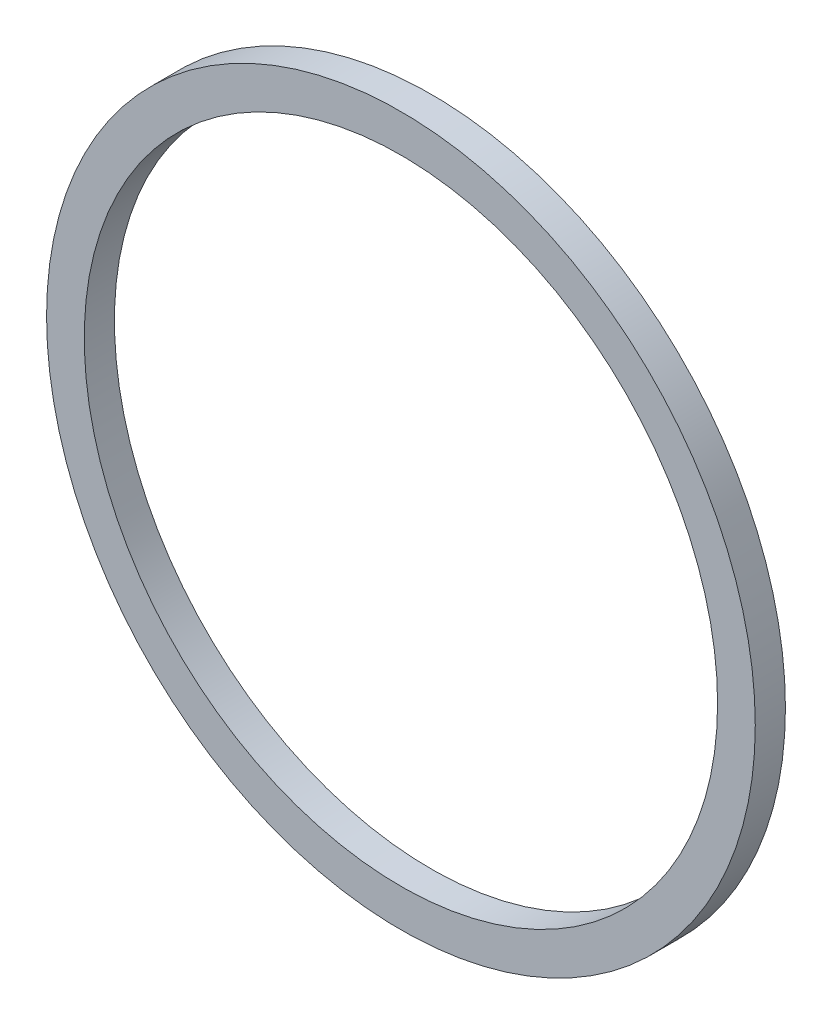
ISO-10303-21;
HEADER;
FILE_DESCRIPTION(('STEP AP214'),'2;1');
FILE_NAME('part.step','',(''),(''),'','','');
FILE_SCHEMA(('AUTOMOTIVE_DESIGN { 1 0 10303 214 1 1 1 1 }'));
ENDSEC;
DATA;
#1=APPLICATION_CONTEXT('core data for automotive mechanical design processes');
#2=APPLICATION_PROTOCOL_DEFINITION('international standard','automotive_design',2000,#1);
#3=PRODUCT_CONTEXT('',#1,'mechanical');
#4=PRODUCT('Part','Part','',(#3));
#5=PRODUCT_RELATED_PRODUCT_CATEGORY('part','',(#4));
#6=PRODUCT_DEFINITION_FORMATION('','',#4);
#7=PRODUCT_DEFINITION_CONTEXT('part definition',#1,'design');
#8=PRODUCT_DEFINITION('design','',#6,#7);
#9=PRODUCT_DEFINITION_SHAPE('','',#8);
#10=(LENGTH_UNIT() NAMED_UNIT(*) SI_UNIT(.MILLI.,.METRE.));
#11=(NAMED_UNIT(*) PLANE_ANGLE_UNIT() SI_UNIT($,.RADIAN.));
#12=(NAMED_UNIT(*) SI_UNIT($,.STERADIAN.) SOLID_ANGLE_UNIT());
#13=UNCERTAINTY_MEASURE_WITH_UNIT(LENGTH_MEASURE(1.E-05),#10,'distance_accuracy_value','');
#14=(GEOMETRIC_REPRESENTATION_CONTEXT(3) GLOBAL_UNCERTAINTY_ASSIGNED_CONTEXT((#13)) GLOBAL_UNIT_ASSIGNED_CONTEXT((#10,
#11,#12)) REPRESENTATION_CONTEXT('',''));
#15=CARTESIAN_POINT('',(0.,0.,0.));
#16=DIRECTION('',(0.,0.,1.));
#17=DIRECTION('',(1.,0.,0.));
#18=AXIS2_PLACEMENT_3D('',#15,#16,#17);
#19=CARTESIAN_POINT('',(0.,0.,2.));
#20=DIRECTION('',(0.,0.,1.));
#21=DIRECTION('',(1.,0.,0.));
#22=AXIS2_PLACEMENT_3D('',#19,#20,#21);
#23=PLANE('',#22);
#24=CARTESIAN_POINT('',(0.,0.,2.));
#25=DIRECTION('',(0.,0.,1.));
#26=DIRECTION('',(1.,0.,0.));
#27=AXIS2_PLACEMENT_3D('',#24,#25,#26);
#28=CIRCLE('',#27,23.5);
#29=CARTESIAN_POINT('',(23.5,0.,2.));
#30=VERTEX_POINT('',#29);
#31=EDGE_CURVE('E10',#30,#30,#28,.T.);
#32=ORIENTED_EDGE('',*,*,#31,.T.);
#33=EDGE_LOOP('',(#32));
#34=FACE_BOUND('',#33,.T.);
#35=CARTESIAN_POINT('',(0.,0.,2.));
#36=DIRECTION('',(0.,0.,1.));
#37=DIRECTION('',(1.,0.,0.));
#38=AXIS2_PLACEMENT_3D('',#35,#36,#37);
#39=CIRCLE('',#38,21.);
#40=CARTESIAN_POINT('',(21.,0.,2.));
#41=VERTEX_POINT('',#40);
#42=EDGE_CURVE('E43',#41,#41,#39,.T.);
#43=ORIENTED_EDGE('',*,*,#42,.F.);
#44=EDGE_LOOP('',(#43));
#45=FACE_BOUND('',#44,.T.);
#46=ADVANCED_FACE('F32',(#34,#45),#23,.T.);
#47=CARTESIAN_POINT('',(0.,0.,0.));
#48=DIRECTION('',(0.,0.,1.));
#49=DIRECTION('',(1.,0.,0.));
#50=AXIS2_PLACEMENT_3D('',#47,#48,#49);
#51=PLANE('',#50);
#52=CARTESIAN_POINT('',(0.,0.,0.));
#53=DIRECTION('',(0.,0.,1.));
#54=DIRECTION('',(1.,0.,0.));
#55=AXIS2_PLACEMENT_3D('',#52,#53,#54);
#56=CIRCLE('',#55,23.5);
#57=CARTESIAN_POINT('',(23.5,0.,0.));
#58=VERTEX_POINT('',#57);
#59=EDGE_CURVE('E36',#58,#58,#56,.T.);
#60=ORIENTED_EDGE('',*,*,#59,.F.);
#61=EDGE_LOOP('',(#60));
#62=FACE_BOUND('',#61,.T.);
#63=CARTESIAN_POINT('',(0.,0.,0.));
#64=DIRECTION('',(0.,0.,1.));
#65=DIRECTION('',(1.,0.,0.));
#66=AXIS2_PLACEMENT_3D('',#63,#64,#65);
#67=CIRCLE('',#66,21.);
#68=CARTESIAN_POINT('',(21.,0.,0.));
#69=VERTEX_POINT('',#68);
#70=EDGE_CURVE('E45',#69,#69,#67,.T.);
#71=ORIENTED_EDGE('',*,*,#70,.T.);
#72=EDGE_LOOP('',(#71));
#73=FACE_BOUND('',#72,.T.);
#74=ADVANCED_FACE('F55',(#62,#73),#51,.F.);
#75=CARTESIAN_POINT('',(0.,0.,2.));
#76=DIRECTION('',(0.,0.,-1.));
#77=DIRECTION('',(-1.,0.,0.));
#78=AXIS2_PLACEMENT_3D('',#75,#76,#77);
#79=CYLINDRICAL_SURFACE('',#78,23.5);
#80=ORIENTED_EDGE('',*,*,#31,.F.);
#81=EDGE_LOOP('',(#80));
#82=FACE_BOUND('',#81,.T.);
#83=ORIENTED_EDGE('',*,*,#59,.T.);
#84=EDGE_LOOP('',(#83));
#85=FACE_BOUND('',#84,.T.);
#86=ADVANCED_FACE('F34',(#82,#85),#79,.T.);
#87=CARTESIAN_POINT('',(0.,0.,2.));
#88=DIRECTION('',(0.,0.,-1.));
#89=DIRECTION('',(-1.,0.,0.));
#90=AXIS2_PLACEMENT_3D('',#87,#88,#89);
#91=CYLINDRICAL_SURFACE('',#90,21.);
#92=ORIENTED_EDGE('',*,*,#42,.T.);
#93=EDGE_LOOP('',(#92));
#94=FACE_BOUND('',#93,.T.);
#95=ORIENTED_EDGE('',*,*,#70,.F.);
#96=EDGE_LOOP('',(#95));
#97=FACE_BOUND('',#96,.T.);
#98=ADVANCED_FACE('F51',(#94,#97),#91,.F.);
#99=CLOSED_SHELL('',(#46,#74,#86,#98));
#100=MANIFOLD_SOLID_BREP('B2',#99);
#101=ADVANCED_BREP_SHAPE_REPRESENTATION('',(#18,#100),#14);
#102=SHAPE_DEFINITION_REPRESENTATION(#9,#101);
ENDSEC;
END-ISO-10303-21;
